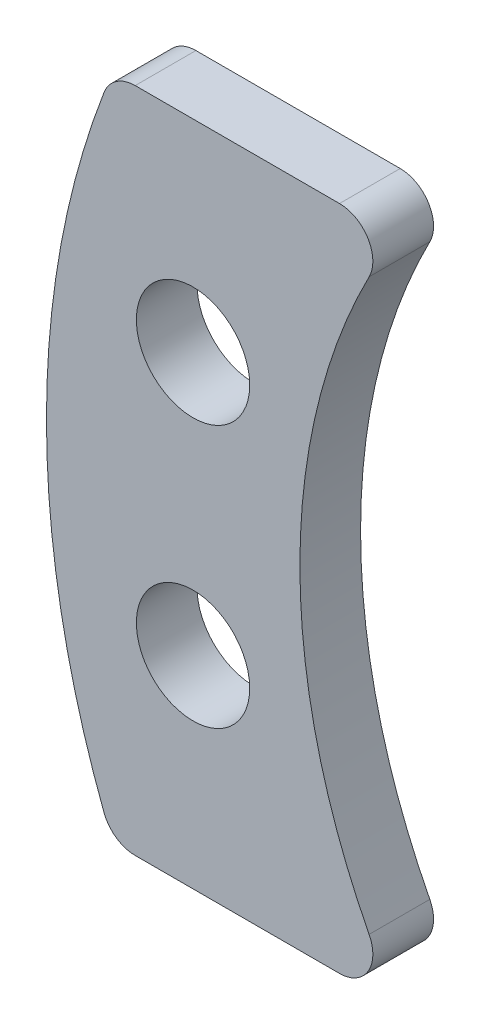
ISO-10303-21;
HEADER;
FILE_DESCRIPTION(('STEP AP214'),'2;1');
FILE_NAME('part.step','',(''),(''),'','','');
FILE_SCHEMA(('AUTOMOTIVE_DESIGN { 1 0 10303 214 1 1 1 1 }'));
ENDSEC;
DATA;
#1=APPLICATION_CONTEXT('core data for automotive mechanical design processes');
#2=APPLICATION_PROTOCOL_DEFINITION('international standard','automotive_design',2000,#1);
#3=PRODUCT_CONTEXT('',#1,'mechanical');
#4=PRODUCT('Part','Part','',(#3));
#5=PRODUCT_RELATED_PRODUCT_CATEGORY('part','',(#4));
#6=PRODUCT_DEFINITION_FORMATION('','',#4);
#7=PRODUCT_DEFINITION_CONTEXT('part definition',#1,'design');
#8=PRODUCT_DEFINITION('design','',#6,#7);
#9=PRODUCT_DEFINITION_SHAPE('','',#8);
#10=(LENGTH_UNIT() NAMED_UNIT(*) SI_UNIT(.MILLI.,.METRE.));
#11=(NAMED_UNIT(*) PLANE_ANGLE_UNIT() SI_UNIT($,.RADIAN.));
#12=(NAMED_UNIT(*) SI_UNIT($,.STERADIAN.) SOLID_ANGLE_UNIT());
#13=UNCERTAINTY_MEASURE_WITH_UNIT(LENGTH_MEASURE(1.E-05),#10,'distance_accuracy_value','');
#14=(GEOMETRIC_REPRESENTATION_CONTEXT(3) GLOBAL_UNCERTAINTY_ASSIGNED_CONTEXT((#13)) GLOBAL_UNIT_ASSIGNED_CONTEXT((#10,
#11,#12)) REPRESENTATION_CONTEXT('',''));
#15=CARTESIAN_POINT('',(0.,0.,0.));
#16=DIRECTION('',(0.,0.,1.));
#17=DIRECTION('',(1.,0.,0.));
#18=AXIS2_PLACEMENT_3D('',#15,#16,#17);
#19=CARTESIAN_POINT('',(31.9877596584683,12.699999967,2.3114));
#20=DIRECTION('',(0.,0.,1.));
#21=DIRECTION('',(1.,0.,0.));
#22=AXIS2_PLACEMENT_3D('',#19,#20,#21);
#23=PLANE('',#22);
#24=CARTESIAN_POINT('',(4.295000046,17.7,2.3114));
#25=DIRECTION('',(0.,0.,1.));
#26=DIRECTION('',(1.,0.,0.));
#27=AXIS2_PLACEMENT_3D('',#24,#25,#26);
#28=CIRCLE('',#27,2.15900000964827);
#29=CARTESIAN_POINT('',(6.45400005564827,17.7,2.3114));
#30=VERTEX_POINT('',#29);
#31=EDGE_CURVE('E131',#30,#30,#28,.T.);
#32=ORIENTED_EDGE('',*,*,#31,.F.);
#33=EDGE_LOOP('',(#32));
#34=FACE_BOUND('',#33,.T.);
#35=CARTESIAN_POINT('',(31.9877596584683,12.699999967,2.3114));
#36=DIRECTION('',(0.,0.,1.));
#37=DIRECTION('',(1.,0.,0.));
#38=AXIS2_PLACEMENT_3D('',#35,#36,#37);
#39=CIRCLE('',#38,33.2760255888386);
#40=CARTESIAN_POINT('',(0.906007903562264,24.583542655754,2.3114));
#41=VERTEX_POINT('',#40);
#42=CARTESIAN_POINT('',(0.90600790356227,0.816457278246004,2.3114));
#43=VERTEX_POINT('',#42);
#44=EDGE_CURVE('E136',#41,#43,#39,.T.);
#45=ORIENTED_EDGE('',*,*,#44,.T.);
#46=CARTESIAN_POINT('',(2.09226209198226,1.27,2.3114));
#47=DIRECTION('',(0.,0.,1.));
#48=DIRECTION('',(1.,0.,0.));
#49=AXIS2_PLACEMENT_3D('',#46,#47,#48);
#50=CIRCLE('',#49,1.27);
#51=CARTESIAN_POINT('',(2.09226209198226,0.,2.3114));
#52=VERTEX_POINT('',#51);
#53=EDGE_CURVE('E151',#43,#52,#50,.T.);
#54=ORIENTED_EDGE('',*,*,#53,.T.);
#55=DIRECTION('',(1.,0.,0.));
#56=VECTOR('',#55,1.);
#57=CARTESIAN_POINT('',(12.0702074785894,0.,2.3114));
#58=LINE('',#57,#56);
#59=CARTESIAN_POINT('',(9.87516675862097,0.,2.3114));
#60=VERTEX_POINT('',#59);
#61=EDGE_CURVE('E118',#52,#60,#58,.T.);
#62=ORIENTED_EDGE('',*,*,#61,.T.);
#63=CARTESIAN_POINT('',(9.87516675862097,1.27,2.3114));
#64=DIRECTION('',(0.,0.,1.));
#65=DIRECTION('',(1.,0.,0.));
#66=AXIS2_PLACEMENT_3D('',#63,#64,#65);
#67=CIRCLE('',#66,1.27);
#68=CARTESIAN_POINT('',(11.0033602739193,1.85316326362245,2.3114));
#69=VERTEX_POINT('',#68);
#70=EDGE_CURVE('E149',#60,#69,#67,.T.);
#71=ORIENTED_EDGE('',*,*,#70,.T.);
#72=CARTESIAN_POINT('',(31.9877596584683,12.699999967,2.3114));
#73=DIRECTION('',(0.,0.,-1.));
#74=DIRECTION('',(1.,0.,0.));
#75=AXIS2_PLACEMENT_3D('',#72,#73,#74);
#76=CIRCLE('',#75,23.622);
#77=CARTESIAN_POINT('',(11.0033602739193,23.5468366703775,2.3114));
#78=VERTEX_POINT('',#77);
#79=EDGE_CURVE('E171',#69,#78,#76,.T.);
#80=ORIENTED_EDGE('',*,*,#79,.T.);
#81=CARTESIAN_POINT('',(9.87516675862096,24.129999934,2.3114));
#82=DIRECTION('',(0.,0.,1.));
#83=DIRECTION('',(1.,0.,0.));
#84=AXIS2_PLACEMENT_3D('',#81,#82,#83);
#85=CIRCLE('',#84,1.27);
#86=CARTESIAN_POINT('',(9.87516675862096,25.399999934,2.3114));
#87=VERTEX_POINT('',#86);
#88=EDGE_CURVE('E53',#78,#87,#85,.T.);
#89=ORIENTED_EDGE('',*,*,#88,.T.);
#90=DIRECTION('',(-1.,0.,0.));
#91=VECTOR('',#90,1.);
#92=CARTESIAN_POINT('',(12.0702074785894,25.399999934,2.3114));
#93=LINE('',#92,#91);
#94=CARTESIAN_POINT('',(2.09226209198226,25.399999934,2.3114));
#95=VERTEX_POINT('',#94);
#96=EDGE_CURVE('E137',#87,#95,#93,.T.);
#97=ORIENTED_EDGE('',*,*,#96,.T.);
#98=CARTESIAN_POINT('',(2.09226209198226,24.129999934,2.3114));
#99=DIRECTION('',(0.,0.,1.));
#100=DIRECTION('',(1.,0.,0.));
#101=AXIS2_PLACEMENT_3D('',#98,#99,#100);
#102=CIRCLE('',#101,1.27);
#103=EDGE_CURVE('E147',#95,#41,#102,.T.);
#104=ORIENTED_EDGE('',*,*,#103,.T.);
#105=EDGE_LOOP('',(#45,#54,#62,#71,#80,#89,#97,#104));
#106=FACE_BOUND('',#105,.T.);
#107=CARTESIAN_POINT('',(4.295000046,7.69999993399999,2.3114));
#108=DIRECTION('',(0.,0.,1.));
#109=DIRECTION('',(1.,0.,0.));
#110=AXIS2_PLACEMENT_3D('',#107,#108,#109);
#111=CIRCLE('',#110,2.15900000964827);
#112=CARTESIAN_POINT('',(6.45400005564827,7.69999993399999,2.3114));
#113=VERTEX_POINT('',#112);
#114=EDGE_CURVE('E183',#113,#113,#111,.T.);
#115=ORIENTED_EDGE('',*,*,#114,.F.);
#116=EDGE_LOOP('',(#115));
#117=FACE_BOUND('',#116,.T.);
#118=ADVANCED_FACE('F33',(#34,#106,#117),#23,.T.);
#119=CARTESIAN_POINT('',(31.9877596584683,12.699999967,0.));
#120=DIRECTION('',(0.,0.,1.));
#121=DIRECTION('',(1.,0.,0.));
#122=AXIS2_PLACEMENT_3D('',#119,#120,#121);
#123=PLANE('',#122);
#124=DIRECTION('',(1.,0.,0.));
#125=VECTOR('',#124,1.);
#126=CARTESIAN_POINT('',(12.0702074785894,0.,0.));
#127=LINE('',#126,#125);
#128=CARTESIAN_POINT('',(2.09226209198226,0.,0.));
#129=VERTEX_POINT('',#128);
#130=CARTESIAN_POINT('',(9.87516675862097,0.,0.));
#131=VERTEX_POINT('',#130);
#132=EDGE_CURVE('E115',#129,#131,#127,.T.);
#133=ORIENTED_EDGE('',*,*,#132,.F.);
#134=CARTESIAN_POINT('',(2.09226209198226,1.27,0.));
#135=DIRECTION('',(0.,0.,1.));
#136=DIRECTION('',(1.,0.,0.));
#137=AXIS2_PLACEMENT_3D('',#134,#135,#136);
#138=CIRCLE('',#137,1.27);
#139=CARTESIAN_POINT('',(0.90600790356227,0.816457278246004,0.));
#140=VERTEX_POINT('',#139);
#141=EDGE_CURVE('E98',#129,#140,#138,.F.);
#142=ORIENTED_EDGE('',*,*,#141,.T.);
#143=CARTESIAN_POINT('',(31.9877596584683,12.699999967,0.));
#144=DIRECTION('',(0.,0.,1.));
#145=DIRECTION('',(1.,0.,0.));
#146=AXIS2_PLACEMENT_3D('',#143,#144,#145);
#147=CIRCLE('',#146,33.2760255888386);
#148=CARTESIAN_POINT('',(0.906007903562264,24.583542655754,0.));
#149=VERTEX_POINT('',#148);
#150=EDGE_CURVE('E126',#149,#140,#147,.T.);
#151=ORIENTED_EDGE('',*,*,#150,.F.);
#152=CARTESIAN_POINT('',(2.09226209198226,24.129999934,0.));
#153=DIRECTION('',(0.,0.,1.));
#154=DIRECTION('',(1.,0.,0.));
#155=AXIS2_PLACEMENT_3D('',#152,#153,#154);
#156=CIRCLE('',#155,1.27);
#157=CARTESIAN_POINT('',(2.09226209198226,25.399999934,0.));
#158=VERTEX_POINT('',#157);
#159=EDGE_CURVE('E140',#149,#158,#156,.F.);
#160=ORIENTED_EDGE('',*,*,#159,.T.);
#161=DIRECTION('',(-1.,0.,0.));
#162=VECTOR('',#161,1.);
#163=CARTESIAN_POINT('',(12.0702074785894,25.399999934,0.));
#164=LINE('',#163,#162);
#165=CARTESIAN_POINT('',(9.87516675862096,25.399999934,0.));
#166=VERTEX_POINT('',#165);
#167=EDGE_CURVE('E129',#166,#158,#164,.T.);
#168=ORIENTED_EDGE('',*,*,#167,.F.);
#169=CARTESIAN_POINT('',(9.87516675862096,24.129999934,0.));
#170=DIRECTION('',(0.,0.,1.));
#171=DIRECTION('',(1.,0.,0.));
#172=AXIS2_PLACEMENT_3D('',#169,#170,#171);
#173=CIRCLE('',#172,1.27);
#174=CARTESIAN_POINT('',(11.0033602739193,23.5468366703775,0.));
#175=VERTEX_POINT('',#174);
#176=EDGE_CURVE('E119',#166,#175,#173,.F.);
#177=ORIENTED_EDGE('',*,*,#176,.T.);
#178=CARTESIAN_POINT('',(31.9877596584683,12.699999967,0.));
#179=DIRECTION('',(0.,0.,-1.));
#180=DIRECTION('',(1.,0.,0.));
#181=AXIS2_PLACEMENT_3D('',#178,#179,#180);
#182=CIRCLE('',#181,23.622);
#183=CARTESIAN_POINT('',(11.0033602739193,1.85316326362245,0.));
#184=VERTEX_POINT('',#183);
#185=EDGE_CURVE('E125',#184,#175,#182,.T.);
#186=ORIENTED_EDGE('',*,*,#185,.F.);
#187=CARTESIAN_POINT('',(9.87516675862097,1.27,0.));
#188=DIRECTION('',(0.,0.,1.));
#189=DIRECTION('',(1.,0.,0.));
#190=AXIS2_PLACEMENT_3D('',#187,#188,#189);
#191=CIRCLE('',#190,1.27);
#192=EDGE_CURVE('E109',#184,#131,#191,.F.);
#193=ORIENTED_EDGE('',*,*,#192,.T.);
#194=EDGE_LOOP('',(#133,#142,#151,#160,#168,#177,#186,#193));
#195=FACE_BOUND('',#194,.T.);
#196=CARTESIAN_POINT('',(4.295000046,17.7,0.));
#197=DIRECTION('',(0.,0.,1.));
#198=DIRECTION('',(1.,0.,0.));
#199=AXIS2_PLACEMENT_3D('',#196,#197,#198);
#200=CIRCLE('',#199,2.15900000964827);
#201=CARTESIAN_POINT('',(6.45400005564827,17.7,0.));
#202=VERTEX_POINT('',#201);
#203=EDGE_CURVE('E174',#202,#202,#200,.T.);
#204=ORIENTED_EDGE('',*,*,#203,.T.);
#205=EDGE_LOOP('',(#204));
#206=FACE_BOUND('',#205,.T.);
#207=CARTESIAN_POINT('',(4.295000046,7.69999993399999,0.));
#208=DIRECTION('',(0.,0.,1.));
#209=DIRECTION('',(1.,0.,0.));
#210=AXIS2_PLACEMENT_3D('',#207,#208,#209);
#211=CIRCLE('',#210,2.15900000964827);
#212=CARTESIAN_POINT('',(6.45400005564827,7.69999993399999,0.));
#213=VERTEX_POINT('',#212);
#214=EDGE_CURVE('E185',#213,#213,#211,.T.);
#215=ORIENTED_EDGE('',*,*,#214,.T.);
#216=EDGE_LOOP('',(#215));
#217=FACE_BOUND('',#216,.T.);
#218=ADVANCED_FACE('F122',(#195,#206,#217),#123,.F.);
#219=CARTESIAN_POINT('',(31.9877596584683,12.699999967,2.3114));
#220=DIRECTION('',(0.,0.,-1.));
#221=DIRECTION('',(-1.,0.,0.));
#222=AXIS2_PLACEMENT_3D('',#219,#220,#221);
#223=CYLINDRICAL_SURFACE('',#222,33.2760255888386);
#224=ORIENTED_EDGE('',*,*,#150,.T.);
#225=DIRECTION('',(0.,0.,-1.));
#226=VECTOR('',#225,1.);
#227=CARTESIAN_POINT('',(0.906007903562264,0.816457278246,2.3114));
#228=LINE('',#227,#226);
#229=EDGE_CURVE('E103',#140,#43,#228,.F.);
#230=ORIENTED_EDGE('',*,*,#229,.T.);
#231=ORIENTED_EDGE('',*,*,#44,.F.);
#232=DIRECTION('',(0.,0.,-1.));
#233=VECTOR('',#232,1.);
#234=CARTESIAN_POINT('',(0.906007903562264,24.583542655754,2.3114));
#235=LINE('',#234,#233);
#236=EDGE_CURVE('E108',#41,#149,#235,.T.);
#237=ORIENTED_EDGE('',*,*,#236,.T.);
#238=EDGE_LOOP('',(#224,#230,#231,#237));
#239=FACE_BOUND('',#238,.T.);
#240=ADVANCED_FACE('F168',(#239),#223,.T.);
#241=CARTESIAN_POINT('',(12.0702074785894,0.,2.3114));
#242=DIRECTION('',(0.,1.,0.));
#243=DIRECTION('',(-1.,0.,0.));
#244=AXIS2_PLACEMENT_3D('',#241,#242,#243);
#245=PLANE('',#244);
#246=ORIENTED_EDGE('',*,*,#61,.F.);
#247=DIRECTION('',(0.,0.,-1.));
#248=VECTOR('',#247,1.);
#249=CARTESIAN_POINT('',(2.09226209198226,0.,2.3114));
#250=LINE('',#249,#248);
#251=EDGE_CURVE('E102',#52,#129,#250,.T.);
#252=ORIENTED_EDGE('',*,*,#251,.T.);
#253=ORIENTED_EDGE('',*,*,#132,.T.);
#254=DIRECTION('',(0.,0.,-1.));
#255=VECTOR('',#254,1.);
#256=CARTESIAN_POINT('',(9.87516675862097,0.,2.3114));
#257=LINE('',#256,#255);
#258=EDGE_CURVE('E120',#131,#60,#257,.F.);
#259=ORIENTED_EDGE('',*,*,#258,.T.);
#260=EDGE_LOOP('',(#246,#252,#253,#259));
#261=FACE_BOUND('',#260,.T.);
#262=ADVANCED_FACE('F114',(#261),#245,.F.);
#263=CARTESIAN_POINT('',(31.9877596584683,12.699999967,2.3114));
#264=DIRECTION('',(0.,0.,-1.));
#265=DIRECTION('',(-1.,0.,0.));
#266=AXIS2_PLACEMENT_3D('',#263,#264,#265);
#267=CYLINDRICAL_SURFACE('',#266,23.622);
#268=ORIENTED_EDGE('',*,*,#79,.F.);
#269=DIRECTION('',(0.,0.,-1.));
#270=VECTOR('',#269,1.);
#271=CARTESIAN_POINT('',(11.0033602739193,1.85316326362245,2.3114));
#272=LINE('',#271,#270);
#273=EDGE_CURVE('E155',#69,#184,#272,.T.);
#274=ORIENTED_EDGE('',*,*,#273,.T.);
#275=ORIENTED_EDGE('',*,*,#185,.T.);
#276=DIRECTION('',(0.,0.,-1.));
#277=VECTOR('',#276,1.);
#278=CARTESIAN_POINT('',(11.0033602739193,23.5468366703775,2.3114));
#279=LINE('',#278,#277);
#280=EDGE_CURVE('E153',#175,#78,#279,.F.);
#281=ORIENTED_EDGE('',*,*,#280,.T.);
#282=EDGE_LOOP('',(#268,#274,#275,#281));
#283=FACE_BOUND('',#282,.T.);
#284=ADVANCED_FACE('F214',(#283),#267,.F.);
#285=CARTESIAN_POINT('',(12.0702074785894,25.399999934,2.3114));
#286=DIRECTION('',(0.,-1.,0.));
#287=DIRECTION('',(0.,0.,-1.));
#288=AXIS2_PLACEMENT_3D('',#285,#286,#287);
#289=PLANE('',#288);
#290=ORIENTED_EDGE('',*,*,#167,.T.);
#291=DIRECTION('',(0.,0.,-1.));
#292=VECTOR('',#291,1.);
#293=CARTESIAN_POINT('',(2.09226209198226,25.399999934,2.3114));
#294=LINE('',#293,#292);
#295=EDGE_CURVE('E11',#158,#95,#294,.F.);
#296=ORIENTED_EDGE('',*,*,#295,.T.);
#297=ORIENTED_EDGE('',*,*,#96,.F.);
#298=DIRECTION('',(0.,0.,-1.));
#299=VECTOR('',#298,1.);
#300=CARTESIAN_POINT('',(9.87516675862096,25.399999934,2.3114));
#301=LINE('',#300,#299);
#302=EDGE_CURVE('E41',#87,#166,#301,.T.);
#303=ORIENTED_EDGE('',*,*,#302,.T.);
#304=EDGE_LOOP('',(#290,#296,#297,#303));
#305=FACE_BOUND('',#304,.T.);
#306=ADVANCED_FACE('F160',(#305),#289,.F.);
#307=CARTESIAN_POINT('',(4.295000046,17.7,2.3114));
#308=DIRECTION('',(0.,0.,-1.));
#309=DIRECTION('',(-1.,0.,0.));
#310=AXIS2_PLACEMENT_3D('',#307,#308,#309);
#311=CYLINDRICAL_SURFACE('',#310,2.15900000964827);
#312=ORIENTED_EDGE('',*,*,#31,.T.);
#313=EDGE_LOOP('',(#312));
#314=FACE_BOUND('',#313,.T.);
#315=ORIENTED_EDGE('',*,*,#203,.F.);
#316=EDGE_LOOP('',(#315));
#317=FACE_BOUND('',#316,.T.);
#318=ADVANCED_FACE('F193',(#314,#317),#311,.F.);
#319=CARTESIAN_POINT('',(4.295000046,7.69999993399999,2.3114));
#320=DIRECTION('',(0.,0.,-1.));
#321=DIRECTION('',(-1.,0.,0.));
#322=AXIS2_PLACEMENT_3D('',#319,#320,#321);
#323=CYLINDRICAL_SURFACE('',#322,2.15900000964827);
#324=ORIENTED_EDGE('',*,*,#114,.T.);
#325=EDGE_LOOP('',(#324));
#326=FACE_BOUND('',#325,.T.);
#327=ORIENTED_EDGE('',*,*,#214,.F.);
#328=EDGE_LOOP('',(#327));
#329=FACE_BOUND('',#328,.T.);
#330=ADVANCED_FACE('F196',(#326,#329),#323,.F.);
#331=CARTESIAN_POINT('',(2.09226209198226,1.27,2.3114));
#332=DIRECTION('',(0.,0.,-1.));
#333=DIRECTION('',(-1.,0.,0.));
#334=AXIS2_PLACEMENT_3D('',#331,#332,#333);
#335=CYLINDRICAL_SURFACE('',#334,1.27);
#336=ORIENTED_EDGE('',*,*,#53,.F.);
#337=ORIENTED_EDGE('',*,*,#229,.F.);
#338=ORIENTED_EDGE('',*,*,#141,.F.);
#339=ORIENTED_EDGE('',*,*,#251,.F.);
#340=EDGE_LOOP('',(#336,#337,#338,#339));
#341=FACE_BOUND('',#340,.T.);
#342=ADVANCED_FACE('F101',(#341),#335,.T.);
#343=CARTESIAN_POINT('',(9.87516675862097,1.27,2.3114));
#344=DIRECTION('',(0.,0.,-1.));
#345=DIRECTION('',(-1.,0.,0.));
#346=AXIS2_PLACEMENT_3D('',#343,#344,#345);
#347=CYLINDRICAL_SURFACE('',#346,1.27);
#348=ORIENTED_EDGE('',*,*,#70,.F.);
#349=ORIENTED_EDGE('',*,*,#258,.F.);
#350=ORIENTED_EDGE('',*,*,#192,.F.);
#351=ORIENTED_EDGE('',*,*,#273,.F.);
#352=EDGE_LOOP('',(#348,#349,#350,#351));
#353=FACE_BOUND('',#352,.T.);
#354=ADVANCED_FACE('F209',(#353),#347,.T.);
#355=CARTESIAN_POINT('',(2.09226209198226,24.129999934,2.3114));
#356=DIRECTION('',(0.,0.,-1.));
#357=DIRECTION('',(-1.,0.,0.));
#358=AXIS2_PLACEMENT_3D('',#355,#356,#357);
#359=CYLINDRICAL_SURFACE('',#358,1.27);
#360=ORIENTED_EDGE('',*,*,#103,.F.);
#361=ORIENTED_EDGE('',*,*,#295,.F.);
#362=ORIENTED_EDGE('',*,*,#159,.F.);
#363=ORIENTED_EDGE('',*,*,#236,.F.);
#364=EDGE_LOOP('',(#360,#361,#362,#363));
#365=FACE_BOUND('',#364,.T.);
#366=ADVANCED_FACE('F165',(#365),#359,.T.);
#367=CARTESIAN_POINT('',(9.87516675862096,24.129999934,2.3114));
#368=DIRECTION('',(0.,0.,-1.));
#369=DIRECTION('',(-1.,0.,0.));
#370=AXIS2_PLACEMENT_3D('',#367,#368,#369);
#371=CYLINDRICAL_SURFACE('',#370,1.27);
#372=ORIENTED_EDGE('',*,*,#88,.F.);
#373=ORIENTED_EDGE('',*,*,#280,.F.);
#374=ORIENTED_EDGE('',*,*,#176,.F.);
#375=ORIENTED_EDGE('',*,*,#302,.F.);
#376=EDGE_LOOP('',(#372,#373,#374,#375));
#377=FACE_BOUND('',#376,.T.);
#378=ADVANCED_FACE('F35',(#377),#371,.T.);
#379=CLOSED_SHELL('',(#118,#218,#240,#262,#284,#306,#318,#330,#342,#354,#366,#378));
#380=MANIFOLD_SOLID_BREP('B2',#379);
#381=ADVANCED_BREP_SHAPE_REPRESENTATION('',(#18,#380),#14);
#382=SHAPE_DEFINITION_REPRESENTATION(#9,#381);
ENDSEC;
END-ISO-10303-21;
